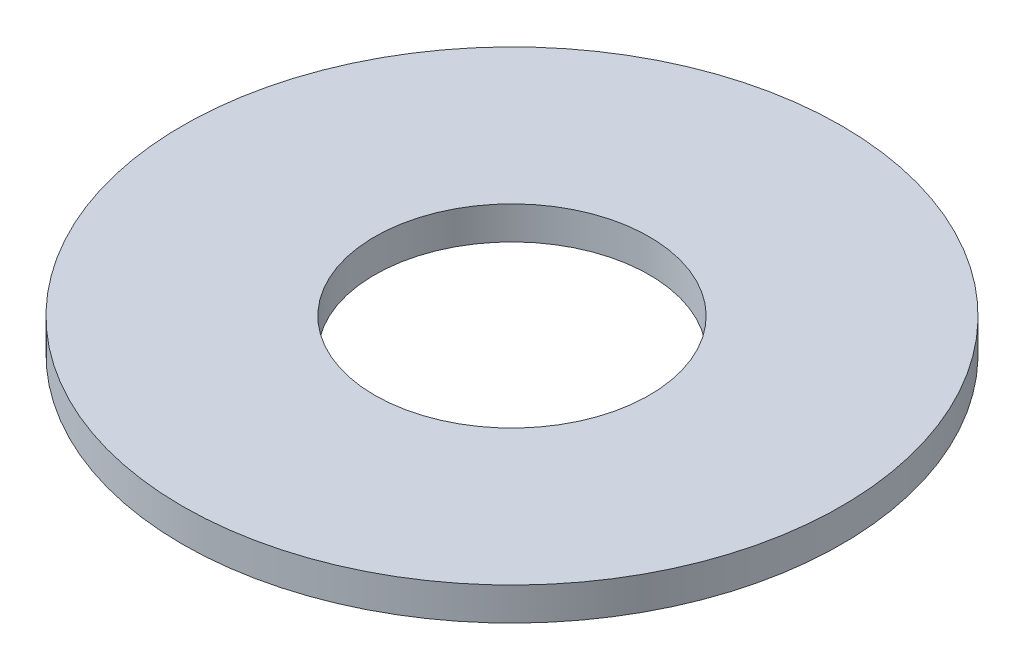
ISO-10303-21;
HEADER;
FILE_DESCRIPTION(('STEP AP214'),'2;1');
FILE_NAME('part.step','',(''),(''),'','','');
FILE_SCHEMA(('AUTOMOTIVE_DESIGN { 1 0 10303 214 1 1 1 1 }'));
ENDSEC;
DATA;
#1=APPLICATION_CONTEXT('core data for automotive mechanical design processes');
#2=APPLICATION_PROTOCOL_DEFINITION('international standard','automotive_design',2000,#1);
#3=PRODUCT_CONTEXT('',#1,'mechanical');
#4=PRODUCT('Part','Part','',(#3));
#5=PRODUCT_RELATED_PRODUCT_CATEGORY('part','',(#4));
#6=PRODUCT_DEFINITION_FORMATION('','',#4);
#7=PRODUCT_DEFINITION_CONTEXT('part definition',#1,'design');
#8=PRODUCT_DEFINITION('design','',#6,#7);
#9=PRODUCT_DEFINITION_SHAPE('','',#8);
#10=(LENGTH_UNIT() NAMED_UNIT(*) SI_UNIT(.MILLI.,.METRE.));
#11=(NAMED_UNIT(*) PLANE_ANGLE_UNIT() SI_UNIT($,.RADIAN.));
#12=(NAMED_UNIT(*) SI_UNIT($,.STERADIAN.) SOLID_ANGLE_UNIT());
#13=UNCERTAINTY_MEASURE_WITH_UNIT(LENGTH_MEASURE(1.E-05),#10,'distance_accuracy_value','');
#14=(GEOMETRIC_REPRESENTATION_CONTEXT(3) GLOBAL_UNCERTAINTY_ASSIGNED_CONTEXT((#13)) GLOBAL_UNIT_ASSIGNED_CONTEXT((#10,
#11,#12)) REPRESENTATION_CONTEXT('',''));
#15=CARTESIAN_POINT('',(0.,0.,0.));
#16=DIRECTION('',(0.,0.,1.));
#17=DIRECTION('',(1.,0.,0.));
#18=AXIS2_PLACEMENT_3D('',#15,#16,#17);
#19=CARTESIAN_POINT('',(0.,9.,0.));
#20=DIRECTION('',(0.,-1.,0.));
#21=DIRECTION('',(0.,0.,-1.));
#22=AXIS2_PLACEMENT_3D('',#19,#20,#21);
#23=CYLINDRICAL_SURFACE('',#22,90.);
#24=CARTESIAN_POINT('',(0.,9.,0.));
#25=DIRECTION('',(0.,1.,0.));
#26=DIRECTION('',(0.,0.,1.));
#27=AXIS2_PLACEMENT_3D('',#24,#25,#26);
#28=CIRCLE('',#27,90.);
#29=CARTESIAN_POINT('',(0.,9.,90.));
#30=VERTEX_POINT('',#29);
#31=EDGE_CURVE('E10',#30,#30,#28,.T.);
#32=ORIENTED_EDGE('',*,*,#31,.F.);
#33=EDGE_LOOP('',(#32));
#34=FACE_BOUND('',#33,.T.);
#35=CARTESIAN_POINT('',(0.,0.,0.));
#36=DIRECTION('',(0.,1.,0.));
#37=DIRECTION('',(0.,0.,1.));
#38=AXIS2_PLACEMENT_3D('',#35,#36,#37);
#39=CIRCLE('',#38,90.);
#40=CARTESIAN_POINT('',(0.,0.,90.));
#41=VERTEX_POINT('',#40);
#42=EDGE_CURVE('E37',#41,#41,#39,.T.);
#43=ORIENTED_EDGE('',*,*,#42,.T.);
#44=EDGE_LOOP('',(#43));
#45=FACE_BOUND('',#44,.T.);
#46=ADVANCED_FACE('F40',(#34,#45),#23,.T.);
#47=CARTESIAN_POINT('',(0.,9.,0.));
#48=DIRECTION('',(0.,1.,0.));
#49=DIRECTION('',(0.,0.,1.));
#50=AXIS2_PLACEMENT_3D('',#47,#48,#49);
#51=PLANE('',#50);
#52=CARTESIAN_POINT('',(0.,9.,0.));
#53=DIRECTION('',(0.,1.,0.));
#54=DIRECTION('',(0.,0.,1.));
#55=AXIS2_PLACEMENT_3D('',#52,#53,#54);
#56=CIRCLE('',#55,37.5);
#57=CARTESIAN_POINT('',(0.,9.,37.5));
#58=VERTEX_POINT('',#57);
#59=EDGE_CURVE('E50',#58,#58,#56,.T.);
#60=ORIENTED_EDGE('',*,*,#59,.F.);
#61=EDGE_LOOP('',(#60));
#62=FACE_BOUND('',#61,.T.);
#63=ORIENTED_EDGE('',*,*,#31,.T.);
#64=EDGE_LOOP('',(#63));
#65=FACE_BOUND('',#64,.T.);
#66=ADVANCED_FACE('F59',(#62,#65),#51,.T.);
#67=CARTESIAN_POINT('',(0.,0.,0.));
#68=DIRECTION('',(0.,1.,0.));
#69=DIRECTION('',(0.,0.,1.));
#70=AXIS2_PLACEMENT_3D('',#67,#68,#69);
#71=PLANE('',#70);
#72=CARTESIAN_POINT('',(0.,0.,0.));
#73=DIRECTION('',(0.,1.,0.));
#74=DIRECTION('',(0.,0.,1.));
#75=AXIS2_PLACEMENT_3D('',#72,#73,#74);
#76=CIRCLE('',#75,37.5);
#77=CARTESIAN_POINT('',(0.,0.,37.5));
#78=VERTEX_POINT('',#77);
#79=EDGE_CURVE('E47',#78,#78,#76,.T.);
#80=ORIENTED_EDGE('',*,*,#79,.T.);
#81=EDGE_LOOP('',(#80));
#82=FACE_BOUND('',#81,.T.);
#83=ORIENTED_EDGE('',*,*,#42,.F.);
#84=EDGE_LOOP('',(#83));
#85=FACE_BOUND('',#84,.T.);
#86=ADVANCED_FACE('F58',(#82,#85),#71,.F.);
#87=CARTESIAN_POINT('',(0.,9.,0.));
#88=DIRECTION('',(0.,-1.,0.));
#89=DIRECTION('',(0.,0.,-1.));
#90=AXIS2_PLACEMENT_3D('',#87,#88,#89);
#91=CYLINDRICAL_SURFACE('',#90,37.5);
#92=ORIENTED_EDGE('',*,*,#59,.T.);
#93=EDGE_LOOP('',(#92));
#94=FACE_BOUND('',#93,.T.);
#95=ORIENTED_EDGE('',*,*,#79,.F.);
#96=EDGE_LOOP('',(#95));
#97=FACE_BOUND('',#96,.T.);
#98=ADVANCED_FACE('F54',(#94,#97),#91,.F.);
#99=CLOSED_SHELL('',(#46,#66,#86,#98));
#100=MANIFOLD_SOLID_BREP('B2',#99);
#101=ADVANCED_BREP_SHAPE_REPRESENTATION('',(#18,#100),#14);
#102=SHAPE_DEFINITION_REPRESENTATION(#9,#101);
ENDSEC;
END-ISO-10303-21;
